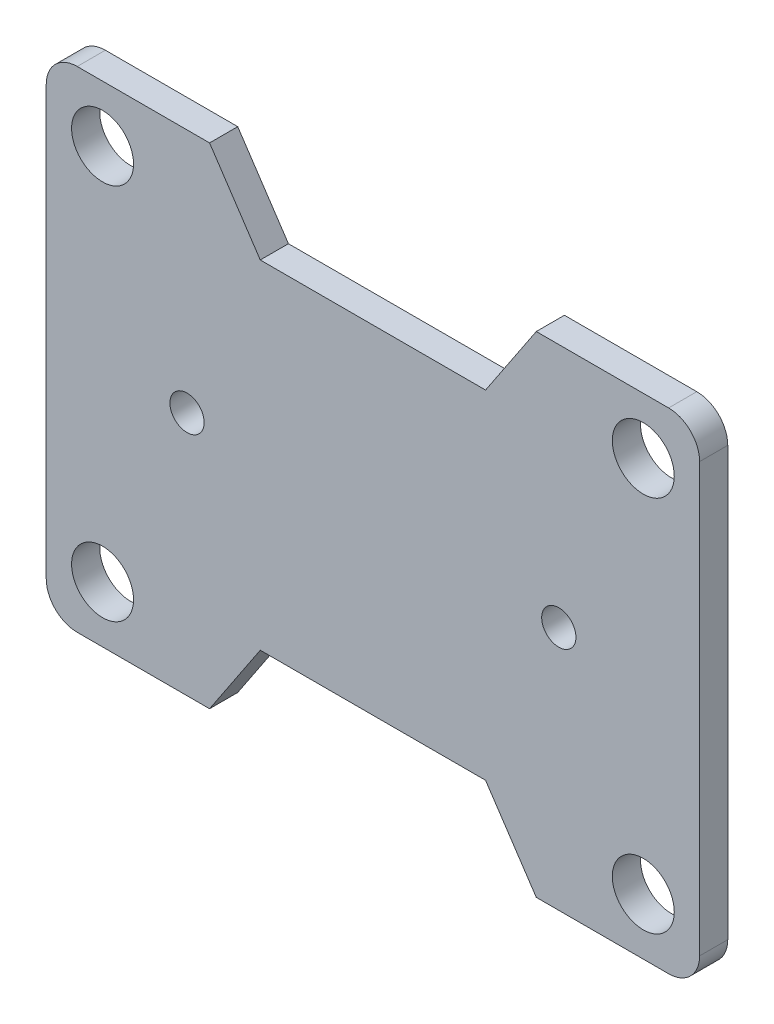
ISO-10303-21;
HEADER;
FILE_DESCRIPTION(('STEP AP214'),'2;1');
FILE_NAME('part.step','',(''),(''),'','','');
FILE_SCHEMA(('AUTOMOTIVE_DESIGN { 1 0 10303 214 1 1 1 1 }'));
ENDSEC;
DATA;
#1=APPLICATION_CONTEXT('core data for automotive mechanical design processes');
#2=APPLICATION_PROTOCOL_DEFINITION('international standard','automotive_design',2000,#1);
#3=PRODUCT_CONTEXT('',#1,'mechanical');
#4=PRODUCT('Part','Part','',(#3));
#5=PRODUCT_RELATED_PRODUCT_CATEGORY('part','',(#4));
#6=PRODUCT_DEFINITION_FORMATION('','',#4);
#7=PRODUCT_DEFINITION_CONTEXT('part definition',#1,'design');
#8=PRODUCT_DEFINITION('design','',#6,#7);
#9=PRODUCT_DEFINITION_SHAPE('','',#8);
#10=(LENGTH_UNIT() NAMED_UNIT(*) SI_UNIT(.MILLI.,.METRE.));
#11=(NAMED_UNIT(*) PLANE_ANGLE_UNIT() SI_UNIT($,.RADIAN.));
#12=(NAMED_UNIT(*) SI_UNIT($,.STERADIAN.) SOLID_ANGLE_UNIT());
#13=UNCERTAINTY_MEASURE_WITH_UNIT(LENGTH_MEASURE(1.E-05),#10,'distance_accuracy_value','');
#14=(GEOMETRIC_REPRESENTATION_CONTEXT(3) GLOBAL_UNCERTAINTY_ASSIGNED_CONTEXT((#13)) GLOBAL_UNIT_ASSIGNED_CONTEXT((#10,
#11,#12)) REPRESENTATION_CONTEXT('',''));
#15=CARTESIAN_POINT('',(0.,0.,0.));
#16=DIRECTION('',(0.,0.,1.));
#17=DIRECTION('',(1.,0.,0.));
#18=AXIS2_PLACEMENT_3D('',#15,#16,#17);
#19=CARTESIAN_POINT('',(53.,0.,2.5));
#20=DIRECTION('',(-1.,0.,0.));
#21=DIRECTION('',(0.,0.,1.));
#22=AXIS2_PLACEMENT_3D('',#19,#20,#21);
#23=PLANE('',#22);
#24=DIRECTION('',(0.,1.,0.));
#25=VECTOR('',#24,1.);
#26=CARTESIAN_POINT('',(53.,0.,0.));
#27=LINE('',#26,#25);
#28=CARTESIAN_POINT('',(53.,-2.25,0.));
#29=VERTEX_POINT('',#28);
#30=CARTESIAN_POINT('',(53.,35.75,0.));
#31=VERTEX_POINT('',#30);
#32=EDGE_CURVE('E226',#29,#31,#27,.T.);
#33=ORIENTED_EDGE('',*,*,#32,.T.);
#34=DIRECTION('',(0.,0.,-1.));
#35=VECTOR('',#34,1.);
#36=CARTESIAN_POINT('',(53.,35.75,2.5));
#37=LINE('',#36,#35);
#38=CARTESIAN_POINT('',(53.,35.75,2.5));
#39=VERTEX_POINT('',#38);
#40=EDGE_CURVE('E300',#31,#39,#37,.F.);
#41=ORIENTED_EDGE('',*,*,#40,.T.);
#42=DIRECTION('',(0.,1.,0.));
#43=VECTOR('',#42,1.);
#44=CARTESIAN_POINT('',(53.,0.,2.5));
#45=LINE('',#44,#43);
#46=CARTESIAN_POINT('',(53.,-2.25,2.5));
#47=VERTEX_POINT('',#46);
#48=EDGE_CURVE('E168',#47,#39,#45,.T.);
#49=ORIENTED_EDGE('',*,*,#48,.F.);
#50=DIRECTION('',(0.,0.,-1.));
#51=VECTOR('',#50,1.);
#52=CARTESIAN_POINT('',(53.,-2.25,2.5));
#53=LINE('',#52,#51);
#54=EDGE_CURVE('E297',#47,#29,#53,.T.);
#55=ORIENTED_EDGE('',*,*,#54,.T.);
#56=EDGE_LOOP('',(#33,#41,#49,#55));
#57=FACE_BOUND('',#56,.T.);
#58=ADVANCED_FACE('F41',(#57),#23,.F.);
#59=CARTESIAN_POINT('',(0.,38.5,2.5));
#60=DIRECTION('',(0.,-1.,0.));
#61=DIRECTION('',(0.,0.,-1.));
#62=AXIS2_PLACEMENT_3D('',#59,#60,#61);
#63=PLANE('',#62);
#64=DIRECTION('',(-1.,0.,0.));
#65=VECTOR('',#64,1.);
#66=CARTESIAN_POINT('',(0.,38.5,2.5));
#67=LINE('',#66,#65);
#68=CARTESIAN_POINT('',(50.25,38.5,2.5));
#69=VERTEX_POINT('',#68);
#70=CARTESIAN_POINT('',(38.5,38.5,2.5));
#71=VERTEX_POINT('',#70);
#72=EDGE_CURVE('E156',#69,#71,#67,.T.);
#73=ORIENTED_EDGE('',*,*,#72,.F.);
#74=DIRECTION('',(0.,0.,-1.));
#75=VECTOR('',#74,1.);
#76=CARTESIAN_POINT('',(50.25,38.5,2.5));
#77=LINE('',#76,#75);
#78=CARTESIAN_POINT('',(50.25,38.5,0.));
#79=VERTEX_POINT('',#78);
#80=EDGE_CURVE('E178',#69,#79,#77,.T.);
#81=ORIENTED_EDGE('',*,*,#80,.T.);
#82=DIRECTION('',(-1.,0.,0.));
#83=VECTOR('',#82,1.);
#84=CARTESIAN_POINT('',(0.,38.5,0.));
#85=LINE('',#84,#83);
#86=CARTESIAN_POINT('',(38.5,38.5,0.));
#87=VERTEX_POINT('',#86);
#88=EDGE_CURVE('E174',#79,#87,#85,.T.);
#89=ORIENTED_EDGE('',*,*,#88,.T.);
#90=DIRECTION('',(0.,0.,-1.));
#91=VECTOR('',#90,1.);
#92=CARTESIAN_POINT('',(38.5,38.5,2.5));
#93=LINE('',#92,#91);
#94=EDGE_CURVE('E171',#71,#87,#93,.T.);
#95=ORIENTED_EDGE('',*,*,#94,.F.);
#96=EDGE_LOOP('',(#73,#81,#89,#95));
#97=FACE_BOUND('',#96,.T.);
#98=ADVANCED_FACE('F172',(#97),#63,.F.);
#99=CARTESIAN_POINT('',(8.88461538461537,-5.92307692307692,2.5));
#100=DIRECTION('',(-0.832050294337844,0.554700196225229,0.));
#101=DIRECTION('',(-0.554700196225229,-0.832050294337844,0.));
#102=AXIS2_PLACEMENT_3D('',#99,#100,#101);
#103=PLANE('',#102);
#104=DIRECTION('',(0.554700196225229,0.832050294337844,0.));
#105=VECTOR('',#104,1.);
#106=CARTESIAN_POINT('',(8.88461538461537,-5.92307692307692,0.));
#107=LINE('',#106,#105);
#108=CARTESIAN_POINT('',(34.,31.75,0.));
#109=VERTEX_POINT('',#108);
#110=EDGE_CURVE('E230',#109,#87,#107,.T.);
#111=ORIENTED_EDGE('',*,*,#110,.F.);
#112=DIRECTION('',(0.,0.,-1.));
#113=VECTOR('',#112,1.);
#114=CARTESIAN_POINT('',(34.,31.75,2.5));
#115=LINE('',#114,#113);
#116=CARTESIAN_POINT('',(34.,31.75,2.5));
#117=VERTEX_POINT('',#116);
#118=EDGE_CURVE('E179',#117,#109,#115,.T.);
#119=ORIENTED_EDGE('',*,*,#118,.F.);
#120=DIRECTION('',(0.554700196225229,0.832050294337844,0.));
#121=VECTOR('',#120,1.);
#122=CARTESIAN_POINT('',(8.88461538461537,-5.92307692307692,2.5));
#123=LINE('',#122,#121);
#124=EDGE_CURVE('E162',#117,#71,#123,.T.);
#125=ORIENTED_EDGE('',*,*,#124,.T.);
#126=ORIENTED_EDGE('',*,*,#94,.T.);
#127=EDGE_LOOP('',(#111,#119,#125,#126));
#128=FACE_BOUND('',#127,.T.);
#129=ADVANCED_FACE('F181',(#128),#103,.T.);
#130=CARTESIAN_POINT('',(0.,31.75,2.5));
#131=DIRECTION('',(0.,-1.,0.));
#132=DIRECTION('',(0.,0.,-1.));
#133=AXIS2_PLACEMENT_3D('',#130,#131,#132);
#134=PLANE('',#133);
#135=DIRECTION('',(-1.,0.,0.));
#136=VECTOR('',#135,1.);
#137=CARTESIAN_POINT('',(0.,31.75,0.));
#138=LINE('',#137,#136);
#139=CARTESIAN_POINT('',(14.,31.75,0.));
#140=VERTEX_POINT('',#139);
#141=EDGE_CURVE('E232',#109,#140,#138,.T.);
#142=ORIENTED_EDGE('',*,*,#141,.T.);
#143=DIRECTION('',(0.,0.,-1.));
#144=VECTOR('',#143,1.);
#145=CARTESIAN_POINT('',(14.,31.75,2.5));
#146=LINE('',#145,#144);
#147=CARTESIAN_POINT('',(14.,31.75,2.5));
#148=VERTEX_POINT('',#147);
#149=EDGE_CURVE('E285',#148,#140,#146,.T.);
#150=ORIENTED_EDGE('',*,*,#149,.F.);
#151=DIRECTION('',(-1.,0.,0.));
#152=VECTOR('',#151,1.);
#153=CARTESIAN_POINT('',(0.,31.75,2.5));
#154=LINE('',#153,#152);
#155=EDGE_CURVE('E183',#117,#148,#154,.T.);
#156=ORIENTED_EDGE('',*,*,#155,.F.);
#157=ORIENTED_EDGE('',*,*,#118,.T.);
#158=EDGE_LOOP('',(#142,#150,#156,#157));
#159=FACE_BOUND('',#158,.T.);
#160=ADVANCED_FACE('F373',(#159),#134,.F.);
#161=CARTESIAN_POINT('',(24.3461538461538,16.2307692307693,2.5));
#162=DIRECTION('',(0.832050294337843,0.55470019622523,0.));
#163=DIRECTION('',(-0.55470019622523,0.832050294337843,0.));
#164=AXIS2_PLACEMENT_3D('',#161,#162,#163);
#165=PLANE('',#164);
#166=DIRECTION('',(0.55470019622523,-0.832050294337843,0.));
#167=VECTOR('',#166,1.);
#168=CARTESIAN_POINT('',(24.3461538461538,16.2307692307693,0.));
#169=LINE('',#168,#167);
#170=CARTESIAN_POINT('',(9.5,38.5,0.));
#171=VERTEX_POINT('',#170);
#172=EDGE_CURVE('E235',#171,#140,#169,.T.);
#173=ORIENTED_EDGE('',*,*,#172,.F.);
#174=DIRECTION('',(0.,0.,-1.));
#175=VECTOR('',#174,1.);
#176=CARTESIAN_POINT('',(9.5,38.5,2.5));
#177=LINE('',#176,#175);
#178=CARTESIAN_POINT('',(9.5,38.5,2.5));
#179=VERTEX_POINT('',#178);
#180=EDGE_CURVE('E282',#179,#171,#177,.T.);
#181=ORIENTED_EDGE('',*,*,#180,.F.);
#182=DIRECTION('',(0.55470019622523,-0.832050294337843,0.));
#183=VECTOR('',#182,1.);
#184=CARTESIAN_POINT('',(24.3461538461538,16.2307692307693,2.5));
#185=LINE('',#184,#183);
#186=EDGE_CURVE('E185',#179,#148,#185,.T.);
#187=ORIENTED_EDGE('',*,*,#186,.T.);
#188=ORIENTED_EDGE('',*,*,#149,.T.);
#189=EDGE_LOOP('',(#173,#181,#187,#188));
#190=FACE_BOUND('',#189,.T.);
#191=ADVANCED_FACE('F376',(#190),#165,.T.);
#192=CARTESIAN_POINT('',(0.,38.5,2.5));
#193=DIRECTION('',(0.,1.,0.));
#194=DIRECTION('',(0.,0.,1.));
#195=AXIS2_PLACEMENT_3D('',#192,#193,#194);
#196=PLANE('',#195);
#197=DIRECTION('',(1.,0.,0.));
#198=VECTOR('',#197,1.);
#199=CARTESIAN_POINT('',(0.,38.5,0.));
#200=LINE('',#199,#198);
#201=CARTESIAN_POINT('',(-2.25,38.5,0.));
#202=VERTEX_POINT('',#201);
#203=EDGE_CURVE('E238',#202,#171,#200,.T.);
#204=ORIENTED_EDGE('',*,*,#203,.F.);
#205=DIRECTION('',(0.,0.,-1.));
#206=VECTOR('',#205,1.);
#207=CARTESIAN_POINT('',(-2.25,38.5,2.5));
#208=LINE('',#207,#206);
#209=CARTESIAN_POINT('',(-2.25,38.5,2.5));
#210=VERTEX_POINT('',#209);
#211=EDGE_CURVE('E11',#202,#210,#208,.F.);
#212=ORIENTED_EDGE('',*,*,#211,.T.);
#213=DIRECTION('',(1.,0.,0.));
#214=VECTOR('',#213,1.);
#215=CARTESIAN_POINT('',(0.,38.5,2.5));
#216=LINE('',#215,#214);
#217=EDGE_CURVE('E191',#210,#179,#216,.T.);
#218=ORIENTED_EDGE('',*,*,#217,.T.);
#219=ORIENTED_EDGE('',*,*,#180,.T.);
#220=EDGE_LOOP('',(#204,#212,#218,#219));
#221=FACE_BOUND('',#220,.T.);
#222=ADVANCED_FACE('F380',(#221),#196,.T.);
#223=CARTESIAN_POINT('',(-5.,0.,2.5));
#224=DIRECTION('',(-1.,0.,0.));
#225=DIRECTION('',(0.,0.,1.));
#226=AXIS2_PLACEMENT_3D('',#223,#224,#225);
#227=PLANE('',#226);
#228=DIRECTION('',(0.,1.,0.));
#229=VECTOR('',#228,1.);
#230=CARTESIAN_POINT('',(-5.,0.,0.));
#231=LINE('',#230,#229);
#232=CARTESIAN_POINT('',(-5.,-2.25,0.));
#233=VERTEX_POINT('',#232);
#234=CARTESIAN_POINT('',(-5.,35.75,0.));
#235=VERTEX_POINT('',#234);
#236=EDGE_CURVE('E240',#233,#235,#231,.T.);
#237=ORIENTED_EDGE('',*,*,#236,.F.);
#238=DIRECTION('',(0.,0.,-1.));
#239=VECTOR('',#238,1.);
#240=CARTESIAN_POINT('',(-5.,-2.25,2.5));
#241=LINE('',#240,#239);
#242=CARTESIAN_POINT('',(-5.,-2.25,2.5));
#243=VERTEX_POINT('',#242);
#244=EDGE_CURVE('E49',#233,#243,#241,.F.);
#245=ORIENTED_EDGE('',*,*,#244,.T.);
#246=DIRECTION('',(0.,1.,0.));
#247=VECTOR('',#246,1.);
#248=CARTESIAN_POINT('',(-5.,0.,2.5));
#249=LINE('',#248,#247);
#250=CARTESIAN_POINT('',(-5.,35.75,2.5));
#251=VERTEX_POINT('',#250);
#252=EDGE_CURVE('E193',#243,#251,#249,.T.);
#253=ORIENTED_EDGE('',*,*,#252,.T.);
#254=DIRECTION('',(0.,0.,-1.));
#255=VECTOR('',#254,1.);
#256=CARTESIAN_POINT('',(-5.,35.75,2.5));
#257=LINE('',#256,#255);
#258=EDGE_CURVE('E312',#251,#235,#257,.T.);
#259=ORIENTED_EDGE('',*,*,#258,.T.);
#260=EDGE_LOOP('',(#237,#245,#253,#259));
#261=FACE_BOUND('',#260,.T.);
#262=ADVANCED_FACE('F317',(#261),#227,.T.);
#263=CARTESIAN_POINT('',(0.,-5.,2.5));
#264=DIRECTION('',(0.,-1.,0.));
#265=DIRECTION('',(0.,0.,-1.));
#266=AXIS2_PLACEMENT_3D('',#263,#264,#265);
#267=PLANE('',#266);
#268=DIRECTION('',(-1.,0.,0.));
#269=VECTOR('',#268,1.);
#270=CARTESIAN_POINT('',(0.,-5.,2.5));
#271=LINE('',#270,#269);
#272=CARTESIAN_POINT('',(9.5,-5.,2.5));
#273=VERTEX_POINT('',#272);
#274=CARTESIAN_POINT('',(-2.25,-5.,2.5));
#275=VERTEX_POINT('',#274);
#276=EDGE_CURVE('E196',#273,#275,#271,.T.);
#277=ORIENTED_EDGE('',*,*,#276,.T.);
#278=DIRECTION('',(0.,0.,-1.));
#279=VECTOR('',#278,1.);
#280=CARTESIAN_POINT('',(-2.25,-5.,2.5));
#281=LINE('',#280,#279);
#282=CARTESIAN_POINT('',(-2.25,-5.,0.));
#283=VERTEX_POINT('',#282);
#284=EDGE_CURVE('E309',#275,#283,#281,.T.);
#285=ORIENTED_EDGE('',*,*,#284,.T.);
#286=DIRECTION('',(-1.,0.,0.));
#287=VECTOR('',#286,1.);
#288=CARTESIAN_POINT('',(0.,-5.,0.));
#289=LINE('',#288,#287);
#290=CARTESIAN_POINT('',(9.5,-5.,0.));
#291=VERTEX_POINT('',#290);
#292=EDGE_CURVE('E243',#291,#283,#289,.T.);
#293=ORIENTED_EDGE('',*,*,#292,.F.);
#294=DIRECTION('',(0.,0.,-1.));
#295=VECTOR('',#294,1.);
#296=CARTESIAN_POINT('',(9.5,-5.,2.5));
#297=LINE('',#296,#295);
#298=EDGE_CURVE('E280',#273,#291,#297,.T.);
#299=ORIENTED_EDGE('',*,*,#298,.F.);
#300=EDGE_LOOP('',(#277,#285,#293,#299));
#301=FACE_BOUND('',#300,.T.);
#302=ADVANCED_FACE('F326',(#301),#267,.T.);
#303=CARTESIAN_POINT('',(8.88461538461539,-5.92307692307692,2.5));
#304=DIRECTION('',(-0.832050294337844,0.554700196225229,0.));
#305=DIRECTION('',(-0.554700196225229,-0.832050294337844,0.));
#306=AXIS2_PLACEMENT_3D('',#303,#304,#305);
#307=PLANE('',#306);
#308=DIRECTION('',(0.554700196225229,0.832050294337844,0.));
#309=VECTOR('',#308,1.);
#310=CARTESIAN_POINT('',(8.88461538461539,-5.92307692307692,0.));
#311=LINE('',#310,#309);
#312=CARTESIAN_POINT('',(14.,1.75,0.));
#313=VERTEX_POINT('',#312);
#314=EDGE_CURVE('E246',#291,#313,#311,.T.);
#315=ORIENTED_EDGE('',*,*,#314,.T.);
#316=DIRECTION('',(0.,0.,-1.));
#317=VECTOR('',#316,1.);
#318=CARTESIAN_POINT('',(14.,1.75,2.5));
#319=LINE('',#318,#317);
#320=CARTESIAN_POINT('',(14.,1.75,2.5));
#321=VERTEX_POINT('',#320);
#322=EDGE_CURVE('E278',#321,#313,#319,.T.);
#323=ORIENTED_EDGE('',*,*,#322,.F.);
#324=DIRECTION('',(0.554700196225229,0.832050294337844,0.));
#325=VECTOR('',#324,1.);
#326=CARTESIAN_POINT('',(8.88461538461539,-5.92307692307692,2.5));
#327=LINE('',#326,#325);
#328=EDGE_CURVE('E198',#273,#321,#327,.T.);
#329=ORIENTED_EDGE('',*,*,#328,.F.);
#330=ORIENTED_EDGE('',*,*,#298,.T.);
#331=EDGE_LOOP('',(#315,#323,#329,#330));
#332=FACE_BOUND('',#331,.T.);
#333=ADVANCED_FACE('F335',(#332),#307,.F.);
#334=CARTESIAN_POINT('',(0.,1.75,2.5));
#335=DIRECTION('',(0.,-1.,0.));
#336=DIRECTION('',(0.,0.,-1.));
#337=AXIS2_PLACEMENT_3D('',#334,#335,#336);
#338=PLANE('',#337);
#339=DIRECTION('',(-1.,0.,0.));
#340=VECTOR('',#339,1.);
#341=CARTESIAN_POINT('',(0.,1.75,0.));
#342=LINE('',#341,#340);
#343=CARTESIAN_POINT('',(34.,1.75,0.));
#344=VERTEX_POINT('',#343);
#345=EDGE_CURVE('E249',#344,#313,#342,.T.);
#346=ORIENTED_EDGE('',*,*,#345,.F.);
#347=DIRECTION('',(0.,0.,-1.));
#348=VECTOR('',#347,1.);
#349=CARTESIAN_POINT('',(34.,1.75,2.5));
#350=LINE('',#349,#348);
#351=CARTESIAN_POINT('',(34.,1.75,2.5));
#352=VERTEX_POINT('',#351);
#353=EDGE_CURVE('E276',#352,#344,#350,.T.);
#354=ORIENTED_EDGE('',*,*,#353,.F.);
#355=DIRECTION('',(-1.,0.,0.));
#356=VECTOR('',#355,1.);
#357=CARTESIAN_POINT('',(0.,1.75,2.5));
#358=LINE('',#357,#356);
#359=EDGE_CURVE('E200',#352,#321,#358,.T.);
#360=ORIENTED_EDGE('',*,*,#359,.T.);
#361=ORIENTED_EDGE('',*,*,#322,.T.);
#362=EDGE_LOOP('',(#346,#354,#360,#361));
#363=FACE_BOUND('',#362,.T.);
#364=ADVANCED_FACE('F341',(#363),#338,.T.);
#365=CARTESIAN_POINT('',(24.3461538461539,16.2307692307692,2.5));
#366=DIRECTION('',(0.832050294337844,0.554700196225229,0.));
#367=DIRECTION('',(-0.554700196225229,0.832050294337844,0.));
#368=AXIS2_PLACEMENT_3D('',#365,#366,#367);
#369=PLANE('',#368);
#370=DIRECTION('',(0.554700196225229,-0.832050294337844,0.));
#371=VECTOR('',#370,1.);
#372=CARTESIAN_POINT('',(24.3461538461539,16.2307692307692,0.));
#373=LINE('',#372,#371);
#374=CARTESIAN_POINT('',(38.5,-5.,0.));
#375=VERTEX_POINT('',#374);
#376=EDGE_CURVE('E252',#344,#375,#373,.T.);
#377=ORIENTED_EDGE('',*,*,#376,.T.);
#378=DIRECTION('',(0.,0.,-1.));
#379=VECTOR('',#378,1.);
#380=CARTESIAN_POINT('',(38.5,-5.,2.5));
#381=LINE('',#380,#379);
#382=CARTESIAN_POINT('',(38.5,-5.,2.5));
#383=VERTEX_POINT('',#382);
#384=EDGE_CURVE('E225',#383,#375,#381,.T.);
#385=ORIENTED_EDGE('',*,*,#384,.F.);
#386=DIRECTION('',(0.554700196225229,-0.832050294337844,0.));
#387=VECTOR('',#386,1.);
#388=CARTESIAN_POINT('',(24.3461538461539,16.2307692307692,2.5));
#389=LINE('',#388,#387);
#390=EDGE_CURVE('E203',#352,#383,#389,.T.);
#391=ORIENTED_EDGE('',*,*,#390,.F.);
#392=ORIENTED_EDGE('',*,*,#353,.T.);
#393=EDGE_LOOP('',(#377,#385,#391,#392));
#394=FACE_BOUND('',#393,.T.);
#395=ADVANCED_FACE('F343',(#394),#369,.F.);
#396=CARTESIAN_POINT('',(7.5,16.75,2.5));
#397=DIRECTION('',(0.,0.,-1.));
#398=DIRECTION('',(-1.,0.,0.));
#399=AXIS2_PLACEMENT_3D('',#396,#397,#398);
#400=CYLINDRICAL_SURFACE('',#399,1.52);
#401=CARTESIAN_POINT('',(7.5,16.75,2.5));
#402=DIRECTION('',(0.,0.,1.));
#403=DIRECTION('',(1.,0.,0.));
#404=AXIS2_PLACEMENT_3D('',#401,#402,#403);
#405=CIRCLE('',#404,1.52);
#406=CARTESIAN_POINT('',(9.02,16.75,2.5));
#407=VERTEX_POINT('',#406);
#408=EDGE_CURVE('E219',#407,#407,#405,.T.);
#409=ORIENTED_EDGE('',*,*,#408,.T.);
#410=EDGE_LOOP('',(#409));
#411=FACE_BOUND('',#410,.T.);
#412=CARTESIAN_POINT('',(7.5,16.75,0.));
#413=DIRECTION('',(0.,0.,1.));
#414=DIRECTION('',(1.,0.,0.));
#415=AXIS2_PLACEMENT_3D('',#412,#413,#414);
#416=CIRCLE('',#415,1.52);
#417=CARTESIAN_POINT('',(9.02,16.75,0.));
#418=VERTEX_POINT('',#417);
#419=EDGE_CURVE('E268',#418,#418,#416,.T.);
#420=ORIENTED_EDGE('',*,*,#419,.F.);
#421=EDGE_LOOP('',(#420));
#422=FACE_BOUND('',#421,.T.);
#423=ADVANCED_FACE('F395',(#411,#422),#400,.F.);
#424=CARTESIAN_POINT('',(0.,33.5,2.5));
#425=DIRECTION('',(0.,0.,-1.));
#426=DIRECTION('',(-1.,0.,0.));
#427=AXIS2_PLACEMENT_3D('',#424,#425,#426);
#428=CYLINDRICAL_SURFACE('',#427,2.74999999999999);
#429=CARTESIAN_POINT('',(0.,33.5,2.5));
#430=DIRECTION('',(0.,0.,1.));
#431=DIRECTION('',(1.,0.,0.));
#432=AXIS2_PLACEMENT_3D('',#429,#430,#431);
#433=CIRCLE('',#432,2.74999999999999);
#434=CARTESIAN_POINT('',(2.74999999999999,33.5,2.5));
#435=VERTEX_POINT('',#434);
#436=EDGE_CURVE('E216',#435,#435,#433,.T.);
#437=ORIENTED_EDGE('',*,*,#436,.T.);
#438=EDGE_LOOP('',(#437));
#439=FACE_BOUND('',#438,.T.);
#440=CARTESIAN_POINT('',(0.,33.5,0.));
#441=DIRECTION('',(0.,0.,1.));
#442=DIRECTION('',(1.,0.,0.));
#443=AXIS2_PLACEMENT_3D('',#440,#441,#442);
#444=CIRCLE('',#443,2.74999999999999);
#445=CARTESIAN_POINT('',(2.74999999999999,33.5,0.));
#446=VERTEX_POINT('',#445);
#447=EDGE_CURVE('E265',#446,#446,#444,.T.);
#448=ORIENTED_EDGE('',*,*,#447,.F.);
#449=EDGE_LOOP('',(#448));
#450=FACE_BOUND('',#449,.T.);
#451=ADVANCED_FACE('F410',(#439,#450),#428,.F.);
#452=CARTESIAN_POINT('',(48.,0.,2.5));
#453=DIRECTION('',(0.,0.,-1.));
#454=DIRECTION('',(-1.,0.,0.));
#455=AXIS2_PLACEMENT_3D('',#452,#453,#454);
#456=CYLINDRICAL_SURFACE('',#455,2.75);
#457=CARTESIAN_POINT('',(48.,0.,2.5));
#458=DIRECTION('',(0.,0.,1.));
#459=DIRECTION('',(1.,0.,0.));
#460=AXIS2_PLACEMENT_3D('',#457,#458,#459);
#461=CIRCLE('',#460,2.75);
#462=CARTESIAN_POINT('',(50.75,0.,2.5));
#463=VERTEX_POINT('',#462);
#464=EDGE_CURVE('E213',#463,#463,#461,.T.);
#465=ORIENTED_EDGE('',*,*,#464,.T.);
#466=EDGE_LOOP('',(#465));
#467=FACE_BOUND('',#466,.T.);
#468=CARTESIAN_POINT('',(48.,0.,0.));
#469=DIRECTION('',(0.,0.,1.));
#470=DIRECTION('',(1.,0.,0.));
#471=AXIS2_PLACEMENT_3D('',#468,#469,#470);
#472=CIRCLE('',#471,2.75);
#473=CARTESIAN_POINT('',(50.75,0.,0.));
#474=VERTEX_POINT('',#473);
#475=EDGE_CURVE('E262',#474,#474,#472,.T.);
#476=ORIENTED_EDGE('',*,*,#475,.F.);
#477=EDGE_LOOP('',(#476));
#478=FACE_BOUND('',#477,.T.);
#479=ADVANCED_FACE('F406',(#467,#478),#456,.F.);
#480=CARTESIAN_POINT('',(40.5,16.75,2.5));
#481=DIRECTION('',(0.,0.,-1.));
#482=DIRECTION('',(-1.,0.,0.));
#483=AXIS2_PLACEMENT_3D('',#480,#481,#482);
#484=CYLINDRICAL_SURFACE('',#483,1.52);
#485=CARTESIAN_POINT('',(40.5,16.75,2.5));
#486=DIRECTION('',(0.,0.,1.));
#487=DIRECTION('',(1.,0.,0.));
#488=AXIS2_PLACEMENT_3D('',#485,#486,#487);
#489=CIRCLE('',#488,1.52);
#490=CARTESIAN_POINT('',(42.02,16.75,2.5));
#491=VERTEX_POINT('',#490);
#492=EDGE_CURVE('E210',#491,#491,#489,.T.);
#493=ORIENTED_EDGE('',*,*,#492,.T.);
#494=EDGE_LOOP('',(#493));
#495=FACE_BOUND('',#494,.T.);
#496=CARTESIAN_POINT('',(40.5,16.75,0.));
#497=DIRECTION('',(0.,0.,1.));
#498=DIRECTION('',(1.,0.,0.));
#499=AXIS2_PLACEMENT_3D('',#496,#497,#498);
#500=CIRCLE('',#499,1.52);
#501=CARTESIAN_POINT('',(42.02,16.75,0.));
#502=VERTEX_POINT('',#501);
#503=EDGE_CURVE('E259',#502,#502,#500,.T.);
#504=ORIENTED_EDGE('',*,*,#503,.F.);
#505=EDGE_LOOP('',(#504));
#506=FACE_BOUND('',#505,.T.);
#507=ADVANCED_FACE('F402',(#495,#506),#484,.F.);
#508=CARTESIAN_POINT('',(48.,33.5,2.5));
#509=DIRECTION('',(0.,0.,-1.));
#510=DIRECTION('',(-1.,0.,0.));
#511=AXIS2_PLACEMENT_3D('',#508,#509,#510);
#512=CYLINDRICAL_SURFACE('',#511,2.75);
#513=CARTESIAN_POINT('',(48.,33.5,2.5));
#514=DIRECTION('',(0.,0.,1.));
#515=DIRECTION('',(1.,0.,0.));
#516=AXIS2_PLACEMENT_3D('',#513,#514,#515);
#517=CIRCLE('',#516,2.75);
#518=CARTESIAN_POINT('',(50.75,33.5,2.5));
#519=VERTEX_POINT('',#518);
#520=EDGE_CURVE('E207',#519,#519,#517,.T.);
#521=ORIENTED_EDGE('',*,*,#520,.T.);
#522=EDGE_LOOP('',(#521));
#523=FACE_BOUND('',#522,.T.);
#524=CARTESIAN_POINT('',(48.,33.5,0.));
#525=DIRECTION('',(0.,0.,1.));
#526=DIRECTION('',(1.,0.,0.));
#527=AXIS2_PLACEMENT_3D('',#524,#525,#526);
#528=CIRCLE('',#527,2.75);
#529=CARTESIAN_POINT('',(50.75,33.5,0.));
#530=VERTEX_POINT('',#529);
#531=EDGE_CURVE('E256',#530,#530,#528,.T.);
#532=ORIENTED_EDGE('',*,*,#531,.F.);
#533=EDGE_LOOP('',(#532));
#534=FACE_BOUND('',#533,.T.);
#535=ADVANCED_FACE('F399',(#523,#534),#512,.F.);
#536=CARTESIAN_POINT('',(0.,-5.,2.5));
#537=DIRECTION('',(0.,1.,0.));
#538=DIRECTION('',(0.,0.,1.));
#539=AXIS2_PLACEMENT_3D('',#536,#537,#538);
#540=PLANE('',#539);
#541=DIRECTION('',(1.,0.,0.));
#542=VECTOR('',#541,1.);
#543=CARTESIAN_POINT('',(0.,-5.,0.));
#544=LINE('',#543,#542);
#545=CARTESIAN_POINT('',(50.25,-5.,0.));
#546=VERTEX_POINT('',#545);
#547=EDGE_CURVE('E254',#375,#546,#544,.T.);
#548=ORIENTED_EDGE('',*,*,#547,.T.);
#549=DIRECTION('',(0.,0.,-1.));
#550=VECTOR('',#549,1.);
#551=CARTESIAN_POINT('',(50.25,-5.,2.5));
#552=LINE('',#551,#550);
#553=CARTESIAN_POINT('',(50.25,-5.,2.5));
#554=VERTEX_POINT('',#553);
#555=EDGE_CURVE('E56',#546,#554,#552,.F.);
#556=ORIENTED_EDGE('',*,*,#555,.T.);
#557=DIRECTION('',(1.,0.,0.));
#558=VECTOR('',#557,1.);
#559=CARTESIAN_POINT('',(0.,-5.,2.5));
#560=LINE('',#559,#558);
#561=EDGE_CURVE('E205',#383,#554,#560,.T.);
#562=ORIENTED_EDGE('',*,*,#561,.F.);
#563=ORIENTED_EDGE('',*,*,#384,.T.);
#564=EDGE_LOOP('',(#548,#556,#562,#563));
#565=FACE_BOUND('',#564,.T.);
#566=ADVANCED_FACE('F345',(#565),#540,.F.);
#567=CARTESIAN_POINT('',(0.,0.,2.5));
#568=DIRECTION('',(0.,0.,-1.));
#569=DIRECTION('',(-1.,0.,0.));
#570=AXIS2_PLACEMENT_3D('',#567,#568,#569);
#571=CYLINDRICAL_SURFACE('',#570,2.75);
#572=CARTESIAN_POINT('',(0.,0.,2.5));
#573=DIRECTION('',(0.,0.,1.));
#574=DIRECTION('',(1.,0.,0.));
#575=AXIS2_PLACEMENT_3D('',#572,#573,#574);
#576=CIRCLE('',#575,2.75);
#577=CARTESIAN_POINT('',(2.75,0.,2.5));
#578=VERTEX_POINT('',#577);
#579=EDGE_CURVE('E222',#578,#578,#576,.T.);
#580=ORIENTED_EDGE('',*,*,#579,.T.);
#581=EDGE_LOOP('',(#580));
#582=FACE_BOUND('',#581,.T.);
#583=CARTESIAN_POINT('',(0.,0.,0.));
#584=DIRECTION('',(0.,0.,1.));
#585=DIRECTION('',(1.,0.,0.));
#586=AXIS2_PLACEMENT_3D('',#583,#584,#585);
#587=CIRCLE('',#586,2.75);
#588=CARTESIAN_POINT('',(2.75,0.,0.));
#589=VERTEX_POINT('',#588);
#590=EDGE_CURVE('E271',#589,#589,#587,.T.);
#591=ORIENTED_EDGE('',*,*,#590,.F.);
#592=EDGE_LOOP('',(#591));
#593=FACE_BOUND('',#592,.T.);
#594=ADVANCED_FACE('F398',(#582,#593),#571,.F.);
#595=CARTESIAN_POINT('',(0.,0.,2.5));
#596=DIRECTION('',(0.,0.,1.));
#597=DIRECTION('',(1.,0.,0.));
#598=AXIS2_PLACEMENT_3D('',#595,#596,#597);
#599=PLANE('',#598);
#600=ORIENTED_EDGE('',*,*,#48,.T.);
#601=CARTESIAN_POINT('',(50.25,35.75,2.5));
#602=DIRECTION('',(0.,0.,1.));
#603=DIRECTION('',(1.,0.,0.));
#604=AXIS2_PLACEMENT_3D('',#601,#602,#603);
#605=CIRCLE('',#604,2.75);
#606=EDGE_CURVE('E164',#39,#69,#605,.T.);
#607=ORIENTED_EDGE('',*,*,#606,.T.);
#608=ORIENTED_EDGE('',*,*,#72,.T.);
#609=ORIENTED_EDGE('',*,*,#124,.F.);
#610=ORIENTED_EDGE('',*,*,#155,.T.);
#611=ORIENTED_EDGE('',*,*,#186,.F.);
#612=ORIENTED_EDGE('',*,*,#217,.F.);
#613=CARTESIAN_POINT('',(-2.25,35.75,2.5));
#614=DIRECTION('',(0.,0.,1.));
#615=DIRECTION('',(1.,0.,0.));
#616=AXIS2_PLACEMENT_3D('',#613,#614,#615);
#617=CIRCLE('',#616,2.75);
#618=EDGE_CURVE('E302',#210,#251,#617,.T.);
#619=ORIENTED_EDGE('',*,*,#618,.T.);
#620=ORIENTED_EDGE('',*,*,#252,.F.);
#621=CARTESIAN_POINT('',(-2.25,-2.25,2.5));
#622=DIRECTION('',(0.,0.,1.));
#623=DIRECTION('',(1.,0.,0.));
#624=AXIS2_PLACEMENT_3D('',#621,#622,#623);
#625=CIRCLE('',#624,2.75);
#626=EDGE_CURVE('E64',#243,#275,#625,.T.);
#627=ORIENTED_EDGE('',*,*,#626,.T.);
#628=ORIENTED_EDGE('',*,*,#276,.F.);
#629=ORIENTED_EDGE('',*,*,#328,.T.);
#630=ORIENTED_EDGE('',*,*,#359,.F.);
#631=ORIENTED_EDGE('',*,*,#390,.T.);
#632=ORIENTED_EDGE('',*,*,#561,.T.);
#633=CARTESIAN_POINT('',(50.25,-2.25,2.5));
#634=DIRECTION('',(0.,0.,1.));
#635=DIRECTION('',(1.,0.,0.));
#636=AXIS2_PLACEMENT_3D('',#633,#634,#635);
#637=CIRCLE('',#636,2.75);
#638=EDGE_CURVE('E305',#554,#47,#637,.T.);
#639=ORIENTED_EDGE('',*,*,#638,.T.);
#640=EDGE_LOOP('',(#600,#607,#608,#609,#610,#611,#612,#619,#620,#627,#628,#629,#630,#631,#632,#639));
#641=FACE_BOUND('',#640,.T.);
#642=ORIENTED_EDGE('',*,*,#520,.F.);
#643=EDGE_LOOP('',(#642));
#644=FACE_BOUND('',#643,.T.);
#645=ORIENTED_EDGE('',*,*,#492,.F.);
#646=EDGE_LOOP('',(#645));
#647=FACE_BOUND('',#646,.T.);
#648=ORIENTED_EDGE('',*,*,#464,.F.);
#649=EDGE_LOOP('',(#648));
#650=FACE_BOUND('',#649,.T.);
#651=ORIENTED_EDGE('',*,*,#436,.F.);
#652=EDGE_LOOP('',(#651));
#653=FACE_BOUND('',#652,.T.);
#654=ORIENTED_EDGE('',*,*,#408,.F.);
#655=EDGE_LOOP('',(#654));
#656=FACE_BOUND('',#655,.T.);
#657=ORIENTED_EDGE('',*,*,#579,.F.);
#658=EDGE_LOOP('',(#657));
#659=FACE_BOUND('',#658,.T.);
#660=ADVANCED_FACE('F159',(#641,#644,#647,#650,#653,#656,#659),#599,.T.);
#661=CARTESIAN_POINT('',(0.,0.,0.));
#662=DIRECTION('',(0.,0.,1.));
#663=DIRECTION('',(1.,0.,0.));
#664=AXIS2_PLACEMENT_3D('',#661,#662,#663);
#665=PLANE('',#664);
#666=ORIENTED_EDGE('',*,*,#88,.F.);
#667=CARTESIAN_POINT('',(50.25,35.75,0.));
#668=DIRECTION('',(0.,0.,1.));
#669=DIRECTION('',(1.,0.,0.));
#670=AXIS2_PLACEMENT_3D('',#667,#668,#669);
#671=CIRCLE('',#670,2.75);
#672=EDGE_CURVE('E295',#79,#31,#671,.F.);
#673=ORIENTED_EDGE('',*,*,#672,.T.);
#674=ORIENTED_EDGE('',*,*,#32,.F.);
#675=CARTESIAN_POINT('',(50.25,-2.25,0.));
#676=DIRECTION('',(0.,0.,1.));
#677=DIRECTION('',(1.,0.,0.));
#678=AXIS2_PLACEMENT_3D('',#675,#676,#677);
#679=CIRCLE('',#678,2.75);
#680=EDGE_CURVE('E293',#29,#546,#679,.F.);
#681=ORIENTED_EDGE('',*,*,#680,.T.);
#682=ORIENTED_EDGE('',*,*,#547,.F.);
#683=ORIENTED_EDGE('',*,*,#376,.F.);
#684=ORIENTED_EDGE('',*,*,#345,.T.);
#685=ORIENTED_EDGE('',*,*,#314,.F.);
#686=ORIENTED_EDGE('',*,*,#292,.T.);
#687=CARTESIAN_POINT('',(-2.25,-2.25,0.));
#688=DIRECTION('',(0.,0.,1.));
#689=DIRECTION('',(1.,0.,0.));
#690=AXIS2_PLACEMENT_3D('',#687,#688,#689);
#691=CIRCLE('',#690,2.75);
#692=EDGE_CURVE('E291',#283,#233,#691,.F.);
#693=ORIENTED_EDGE('',*,*,#692,.T.);
#694=ORIENTED_EDGE('',*,*,#236,.T.);
#695=CARTESIAN_POINT('',(-2.25,35.75,0.));
#696=DIRECTION('',(0.,0.,1.));
#697=DIRECTION('',(1.,0.,0.));
#698=AXIS2_PLACEMENT_3D('',#695,#696,#697);
#699=CIRCLE('',#698,2.75);
#700=EDGE_CURVE('E289',#235,#202,#699,.F.);
#701=ORIENTED_EDGE('',*,*,#700,.T.);
#702=ORIENTED_EDGE('',*,*,#203,.T.);
#703=ORIENTED_EDGE('',*,*,#172,.T.);
#704=ORIENTED_EDGE('',*,*,#141,.F.);
#705=ORIENTED_EDGE('',*,*,#110,.T.);
#706=EDGE_LOOP('',(#666,#673,#674,#681,#682,#683,#684,#685,#686,#693,#694,#701,#702,#703,#704,#705));
#707=FACE_BOUND('',#706,.T.);
#708=ORIENTED_EDGE('',*,*,#531,.T.);
#709=EDGE_LOOP('',(#708));
#710=FACE_BOUND('',#709,.T.);
#711=ORIENTED_EDGE('',*,*,#503,.T.);
#712=EDGE_LOOP('',(#711));
#713=FACE_BOUND('',#712,.T.);
#714=ORIENTED_EDGE('',*,*,#475,.T.);
#715=EDGE_LOOP('',(#714));
#716=FACE_BOUND('',#715,.T.);
#717=ORIENTED_EDGE('',*,*,#447,.T.);
#718=EDGE_LOOP('',(#717));
#719=FACE_BOUND('',#718,.T.);
#720=ORIENTED_EDGE('',*,*,#419,.T.);
#721=EDGE_LOOP('',(#720));
#722=FACE_BOUND('',#721,.T.);
#723=ORIENTED_EDGE('',*,*,#590,.T.);
#724=EDGE_LOOP('',(#723));
#725=FACE_BOUND('',#724,.T.);
#726=ADVANCED_FACE('F329',(#707,#710,#713,#716,#719,#722,#725),#665,.F.);
#727=CARTESIAN_POINT('',(50.25,35.75,2.5));
#728=DIRECTION('',(0.,0.,-1.));
#729=DIRECTION('',(-1.,0.,0.));
#730=AXIS2_PLACEMENT_3D('',#727,#728,#729);
#731=CYLINDRICAL_SURFACE('',#730,2.75);
#732=ORIENTED_EDGE('',*,*,#606,.F.);
#733=ORIENTED_EDGE('',*,*,#40,.F.);
#734=ORIENTED_EDGE('',*,*,#672,.F.);
#735=ORIENTED_EDGE('',*,*,#80,.F.);
#736=EDGE_LOOP('',(#732,#733,#734,#735));
#737=FACE_BOUND('',#736,.T.);
#738=ADVANCED_FACE('F355',(#737),#731,.T.);
#739=CARTESIAN_POINT('',(50.25,-2.25,2.5));
#740=DIRECTION('',(0.,0.,-1.));
#741=DIRECTION('',(-1.,0.,0.));
#742=AXIS2_PLACEMENT_3D('',#739,#740,#741);
#743=CYLINDRICAL_SURFACE('',#742,2.75);
#744=ORIENTED_EDGE('',*,*,#638,.F.);
#745=ORIENTED_EDGE('',*,*,#555,.F.);
#746=ORIENTED_EDGE('',*,*,#680,.F.);
#747=ORIENTED_EDGE('',*,*,#54,.F.);
#748=EDGE_LOOP('',(#744,#745,#746,#747));
#749=FACE_BOUND('',#748,.T.);
#750=ADVANCED_FACE('F350',(#749),#743,.T.);
#751=CARTESIAN_POINT('',(-2.25,-2.25,2.5));
#752=DIRECTION('',(0.,0.,-1.));
#753=DIRECTION('',(-1.,0.,0.));
#754=AXIS2_PLACEMENT_3D('',#751,#752,#753);
#755=CYLINDRICAL_SURFACE('',#754,2.75);
#756=ORIENTED_EDGE('',*,*,#626,.F.);
#757=ORIENTED_EDGE('',*,*,#244,.F.);
#758=ORIENTED_EDGE('',*,*,#692,.F.);
#759=ORIENTED_EDGE('',*,*,#284,.F.);
#760=EDGE_LOOP('',(#756,#757,#758,#759));
#761=FACE_BOUND('',#760,.T.);
#762=ADVANCED_FACE('F323',(#761),#755,.T.);
#763=CARTESIAN_POINT('',(-2.25,35.75,2.5));
#764=DIRECTION('',(0.,0.,-1.));
#765=DIRECTION('',(-1.,0.,0.));
#766=AXIS2_PLACEMENT_3D('',#763,#764,#765);
#767=CYLINDRICAL_SURFACE('',#766,2.75);
#768=ORIENTED_EDGE('',*,*,#618,.F.);
#769=ORIENTED_EDGE('',*,*,#211,.F.);
#770=ORIENTED_EDGE('',*,*,#700,.F.);
#771=ORIENTED_EDGE('',*,*,#258,.F.);
#772=EDGE_LOOP('',(#768,#769,#770,#771));
#773=FACE_BOUND('',#772,.T.);
#774=ADVANCED_FACE('F43',(#773),#767,.T.);
#775=CLOSED_SHELL('',(#58,#98,#129,#160,#191,#222,#262,#302,#333,#364,#395,#423,#451,#479,#507,
#535,#566,#594,#660,#726,#738,#750,#762,#774));
#776=MANIFOLD_SOLID_BREP('B2',#775);
#777=ADVANCED_BREP_SHAPE_REPRESENTATION('',(#18,#776),#14);
#778=SHAPE_DEFINITION_REPRESENTATION(#9,#777);
ENDSEC;
END-ISO-10303-21;
